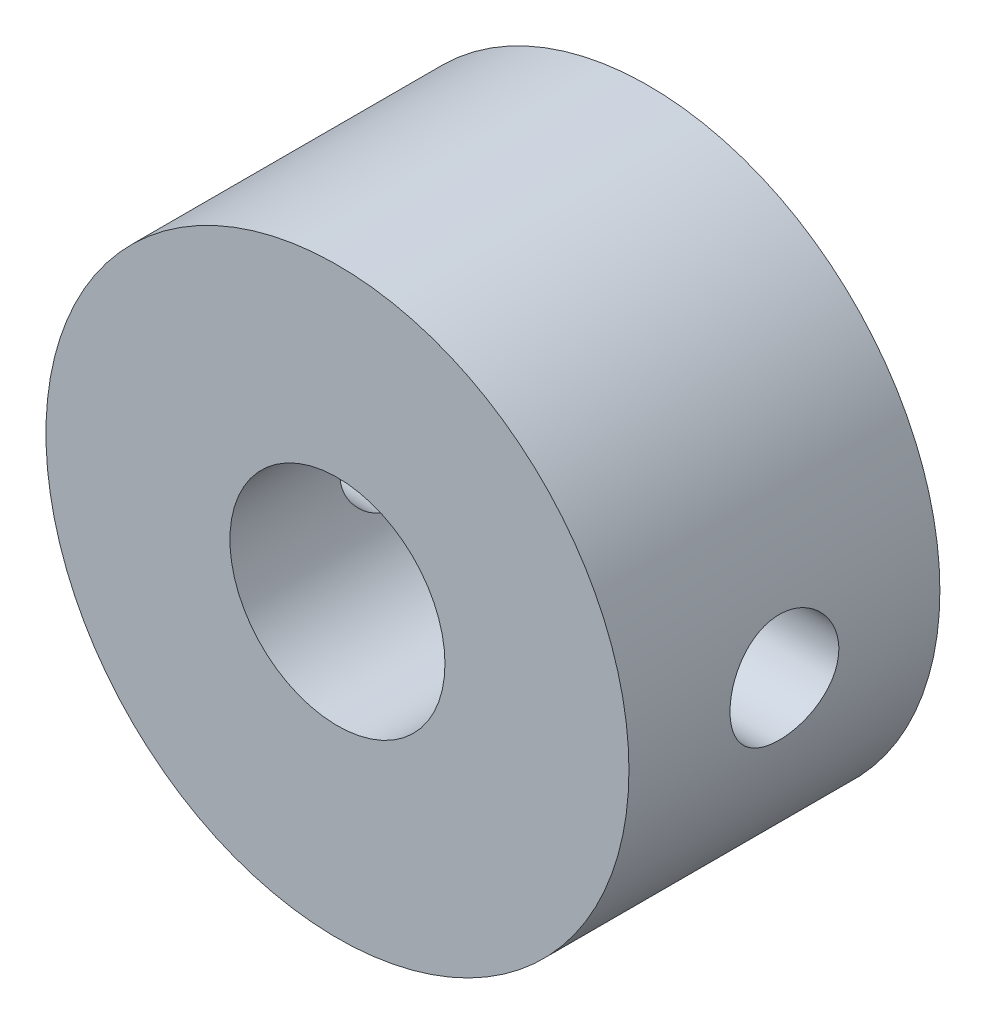
ISO-10303-21;
HEADER;
FILE_DESCRIPTION(('STEP AP214'),'2;1');
FILE_NAME('part.step','',(''),(''),'','','');
FILE_SCHEMA(('AUTOMOTIVE_DESIGN { 1 0 10303 214 1 1 1 1 }'));
ENDSEC;
DATA;
#1=APPLICATION_CONTEXT('core data for automotive mechanical design processes');
#2=APPLICATION_PROTOCOL_DEFINITION('international standard','automotive_design',2000,#1);
#3=PRODUCT_CONTEXT('',#1,'mechanical');
#4=PRODUCT('Part','Part','',(#3));
#5=PRODUCT_RELATED_PRODUCT_CATEGORY('part','',(#4));
#6=PRODUCT_DEFINITION_FORMATION('','',#4);
#7=PRODUCT_DEFINITION_CONTEXT('part definition',#1,'design');
#8=PRODUCT_DEFINITION('design','',#6,#7);
#9=PRODUCT_DEFINITION_SHAPE('','',#8);
#10=(LENGTH_UNIT() NAMED_UNIT(*) SI_UNIT(.MILLI.,.METRE.));
#11=(NAMED_UNIT(*) PLANE_ANGLE_UNIT() SI_UNIT($,.RADIAN.));
#12=(NAMED_UNIT(*) SI_UNIT($,.STERADIAN.) SOLID_ANGLE_UNIT());
#13=UNCERTAINTY_MEASURE_WITH_UNIT(LENGTH_MEASURE(1.E-05),#10,'distance_accuracy_value','');
#14=(GEOMETRIC_REPRESENTATION_CONTEXT(3) GLOBAL_UNCERTAINTY_ASSIGNED_CONTEXT((#13)) GLOBAL_UNIT_ASSIGNED_CONTEXT((#10,
#11,#12)) REPRESENTATION_CONTEXT('',''));
#15=CARTESIAN_POINT('',(0.,0.,0.));
#16=DIRECTION('',(0.,0.,1.));
#17=DIRECTION('',(1.,0.,0.));
#18=AXIS2_PLACEMENT_3D('',#15,#16,#17);
#19=CARTESIAN_POINT('',(0.,0.,12.));
#20=DIRECTION('',(0.,0.,-1.));
#21=DIRECTION('',(-1.,0.,0.));
#22=AXIS2_PLACEMENT_3D('',#19,#20,#21);
#23=CYLINDRICAL_SURFACE('',#22,11.25);
#24=CARTESIAN_POINT('',(11.25,0.,3.9));
#25=CARTESIAN_POINT('',(11.2499978868814,-0.116870051116427,3.90000447590363));
#26=CARTESIAN_POINT('',(11.2481600420372,-0.233798447592149,3.9097891163806));
#27=CARTESIAN_POINT('',(11.2410056507176,-0.464360917815712,3.94864432840249));
#28=CARTESIAN_POINT('',(11.2356861572907,-0.577992115568345,3.97773123814415));
#29=CARTESIAN_POINT('',(11.2221635884025,-0.798592353924978,4.05426986888635));
#30=CARTESIAN_POINT('',(11.2139631074613,-0.905567287240754,4.10170506990465));
#31=CARTESIAN_POINT('',(11.1955743057042,-1.11003012441761,4.21354703185403));
#32=CARTESIAN_POINT('',(11.185386148586,-1.20751880854071,4.27795239533853));
#33=CARTESIAN_POINT('',(11.1640114574066,-1.39140940904741,4.42271833437267));
#34=CARTESIAN_POINT('',(11.1528154579487,-1.47768239185122,4.50324130861667));
#35=CARTESIAN_POINT('',(11.130757285113,-1.63557728497731,4.67760736787961));
#36=CARTESIAN_POINT('',(11.1198951356345,-1.70719814846429,4.77145140382431));
#37=CARTESIAN_POINT('',(11.0996425217549,-1.83429119655592,4.970705812637));
#38=CARTESIAN_POINT('',(11.0902642625609,-1.88963237805692,5.07620109462547));
#39=CARTESIAN_POINT('',(11.07417455029,-1.98175653674892,5.29519586262491));
#40=CARTESIAN_POINT('',(11.0674628693758,-2.01854109952354,5.40869466382455));
#41=CARTESIAN_POINT('',(11.0575614563584,-2.07209436594482,5.63909561411088));
#42=CARTESIAN_POINT('',(11.0543322073595,-2.08908782994632,5.75594378919659));
#43=CARTESIAN_POINT('',(11.051642126767,-2.1032741275287,5.99087402748983));
#44=CARTESIAN_POINT('',(11.0521809602688,-2.10046872081991,6.10895598010858));
#45=CARTESIAN_POINT('',(11.0569301810734,-2.07531919863034,6.34137450229544));
#46=CARTESIAN_POINT('',(11.0610925645397,-2.05323053199279,6.45573983915365));
#47=CARTESIAN_POINT('',(11.0725444989122,-1.99054374047324,6.67911241268042));
#48=CARTESIAN_POINT('',(11.0798341816327,-1.94994483538877,6.78811942328214));
#49=CARTESIAN_POINT('',(11.0967696027246,-1.85113981590752,6.99842919401654));
#50=CARTESIAN_POINT('',(11.1064290941843,-1.79283043153035,7.09968228396997));
#51=CARTESIAN_POINT('',(11.1270066379781,-1.6603326907229,7.2910633009231));
#52=CARTESIAN_POINT('',(11.1379248168951,-1.58614273657983,7.38119010708974));
#53=CARTESIAN_POINT('',(11.1599987710771,-1.42261195754757,7.54923621697663));
#54=CARTESIAN_POINT('',(11.1711555939996,-1.33305261049536,7.62694288889261));
#55=CARTESIAN_POINT('',(11.1922930027306,-1.14205685485682,7.7662610741087));
#56=CARTESIAN_POINT('',(11.2022735769429,-1.04062032919803,7.82787242873913));
#57=CARTESIAN_POINT('',(11.219953826192,-0.828528745855031,7.93328188230094));
#58=CARTESIAN_POINT('',(11.2276506843014,-0.717862517149799,7.97705800637822));
#59=CARTESIAN_POINT('',(11.239874472381,-0.490571733845224,8.04534011685005));
#60=CARTESIAN_POINT('',(11.2444017360527,-0.37394780787197,8.06984813186379));
#61=CARTESIAN_POINT('',(11.2497304386783,-0.139881644484169,8.09860269412022));
#62=CARTESIAN_POINT('',(11.2505854509577,-0.0224763802554546,8.10314060328525));
#63=CARTESIAN_POINT('',(11.2486212472193,0.211415399049241,8.09260748821077));
#64=CARTESIAN_POINT('',(11.2458022100565,0.327901958570639,8.07753741850022));
#65=CARTESIAN_POINT('',(11.2368400115172,0.555726562485133,8.0284583703502));
#66=CARTESIAN_POINT('',(11.2307227134365,0.667097443864289,7.9945966865697));
#67=CARTESIAN_POINT('',(11.2158470873987,0.882581290626657,7.90905491420057));
#68=CARTESIAN_POINT('',(11.2070885813743,0.986693766073727,7.85737362420109));
#69=CARTESIAN_POINT('',(11.1877684460801,1.18594981965344,7.73701386621129));
#70=CARTESIAN_POINT('',(11.1771882977871,1.28098392485225,7.66815719861719));
#71=CARTESIAN_POINT('',(11.1554465897674,1.45825301019646,7.51564257745349));
#72=CARTESIAN_POINT('',(11.1442849763328,1.54048680521568,7.43198325489953));
#73=CARTESIAN_POINT('',(11.1224607802418,1.69092693866486,7.25091956269001));
#74=CARTESIAN_POINT('',(11.1118066935529,1.75893452205378,7.15334885954151));
#75=CARTESIAN_POINT('',(11.0923743313584,1.87759473329097,6.94799713175923));
#76=CARTESIAN_POINT('',(11.0835959865283,1.92824800256965,6.84021648468178));
#77=CARTESIAN_POINT('',(11.0689755852346,2.01047928957847,6.61801109158759));
#78=CARTESIAN_POINT('',(11.0631194788214,2.04214873142304,6.50362114636546));
#79=CARTESIAN_POINT('',(11.0549743761156,2.0857955829765,6.27102440999086));
#80=CARTESIAN_POINT('',(11.0526849813508,2.09777519243751,6.15281804671415));
#81=CARTESIAN_POINT('',(11.0519525995647,2.10162922782366,5.91793453193552));
#82=CARTESIAN_POINT('',(11.0534496373636,2.09381714096807,5.80126259593306));
#83=CARTESIAN_POINT('',(11.0599885186412,2.05899551456732,5.57092608843586));
#84=CARTESIAN_POINT('',(11.0650303413878,2.03198608729999,5.45726149935634));
#85=CARTESIAN_POINT('',(11.0780655519559,1.95966824453777,5.23633284660059));
#86=CARTESIAN_POINT('',(11.0860535090324,1.91439348405176,5.12905742543665));
#87=CARTESIAN_POINT('',(11.10408484369,1.80686435462856,4.92357509552195));
#88=CARTESIAN_POINT('',(11.1141283646886,1.74460880083505,4.8253688202226));
#89=CARTESIAN_POINT('',(11.1353255156762,1.60379420779912,4.63924161538022));
#90=CARTESIAN_POINT('',(11.1464934089391,1.52500691557208,4.5514949657355));
#91=CARTESIAN_POINT('',(11.1685739603769,1.3538415166877,4.390363163059));
#92=CARTESIAN_POINT('',(11.1794865593243,1.26146029181066,4.31698131409473));
#93=CARTESIAN_POINT('',(11.199940980724,1.06474339278036,4.18605177717303));
#94=CARTESIAN_POINT('',(11.2094697210551,0.960308524149111,4.12865102102413));
#95=CARTESIAN_POINT('',(11.2259550719315,0.743133418146286,4.03230149444511));
#96=CARTESIAN_POINT('',(11.2329141032262,0.630401117937854,3.99333534823079));
#97=CARTESIAN_POINT('',(11.2420529504133,0.431110689027436,3.94289599523633));
#98=CARTESIAN_POINT('',(11.2450163018428,0.345719445112447,3.92683741548476));
#99=CARTESIAN_POINT('',(11.2489905868845,0.17356283852604,3.90538788931853));
#100=CARTESIAN_POINT('',(11.2500015693793,0.0867975103132741,3.89999667581825));
#101=CARTESIAN_POINT('',(11.25,0.,3.9));
#102=B_SPLINE_CURVE_WITH_KNOTS('',3,(#24,#25,#26,#27,#28,#29,#30,#31,#32,#33,#34,#35,#36,#37,
#38,#39,#40,#41,#42,#43,#44,#45,#46,#47,#48,#49,#50,#51,#52,#53,#54,#55,#56,#57,#58,#59,#60,#61,
#62,#63,#64,#65,#66,#67,#68,#69,#70,#71,#72,#73,#74,#75,#76,#77,#78,#79,#80,#81,#82,#83,#84,#85,
#86,#87,#88,#89,#90,#91,#92,#93,#94,#95,#96,#97,#98,#99,#100,#101),.UNSPECIFIED.,.T.,.F.,(4,2,2,
2,2,2,2,2,2,2,2,2,2,2,2,2,2,2,2,2,2,2,2,2,2,2,2,2,2,2,2,2,2,2,2,2,2,2,4),(0.,0.350292735739653,
0.700882351808695,1.0511570446316,1.40140290229879,1.75537361189577,2.10936960245812,
2.46614082406495,2.82288155593299,3.1755301392632,3.52814737981906,3.87616312853408,
4.22419354739283,4.57429361698693,4.92442892602752,5.2800324415224,5.63563946246969,
5.99168331269157,6.34768967225222,6.69848433866071,7.0492619287995,7.39732807377546,
7.74541769021477,8.09728110313744,8.44917707424144,8.80570208384587,9.16221391455664,
9.51699473227074,9.8717359111044,10.2208934718768,10.570048990578,10.9185640856239,
11.2671035049747,11.6208157201289,11.9746091977649,12.331555466257,12.6881646167108,
12.9483279206454,13.2084847106235),.UNSPECIFIED.);
#103=CARTESIAN_POINT('',(11.25,0.,3.9));
#104=VERTEX_POINT('',#103);
#105=EDGE_CURVE('E10',#104,#104,#102,.T.);
#106=ORIENTED_EDGE('',*,*,#105,.T.);
#107=EDGE_LOOP('',(#106));
#108=FACE_BOUND('',#107,.T.);
#109=CARTESIAN_POINT('',(0.,0.,12.));
#110=DIRECTION('',(0.,0.,1.));
#111=DIRECTION('',(1.,0.,0.));
#112=AXIS2_PLACEMENT_3D('',#109,#110,#111);
#113=CIRCLE('',#112,11.25);
#114=CARTESIAN_POINT('',(11.25,0.,12.));
#115=VERTEX_POINT('',#114);
#116=EDGE_CURVE('E46',#115,#115,#113,.T.);
#117=ORIENTED_EDGE('',*,*,#116,.F.);
#118=EDGE_LOOP('',(#117));
#119=FACE_BOUND('',#118,.T.);
#120=CARTESIAN_POINT('',(0.,0.,0.));
#121=DIRECTION('',(0.,0.,1.));
#122=DIRECTION('',(1.,0.,0.));
#123=AXIS2_PLACEMENT_3D('',#120,#121,#122);
#124=CIRCLE('',#123,11.25);
#125=CARTESIAN_POINT('',(11.25,0.,0.));
#126=VERTEX_POINT('',#125);
#127=EDGE_CURVE('E51',#126,#126,#124,.T.);
#128=ORIENTED_EDGE('',*,*,#127,.T.);
#129=EDGE_LOOP('',(#128));
#130=FACE_BOUND('',#129,.T.);
#131=CARTESIAN_POINT('',(-11.25,0.,8.1));
#132=CARTESIAN_POINT('',(-11.2499978868814,0.116870051116427,8.09999552409637));
#133=CARTESIAN_POINT('',(-11.2481600420372,0.233798447592149,8.0902108836194));
#134=CARTESIAN_POINT('',(-11.2410056507176,0.464360917815712,8.05135567159751));
#135=CARTESIAN_POINT('',(-11.2356861572907,0.577992115568345,8.02226876185586));
#136=CARTESIAN_POINT('',(-11.2221635884025,0.798592353924978,7.94573013111365));
#137=CARTESIAN_POINT('',(-11.2139631074613,0.905567287240754,7.89829493009535));
#138=CARTESIAN_POINT('',(-11.1955743057042,1.11003012441761,7.78645296814597));
#139=CARTESIAN_POINT('',(-11.185386148586,1.20751880854071,7.72204760466147));
#140=CARTESIAN_POINT('',(-11.1640114574066,1.39140940904741,7.57728166562733));
#141=CARTESIAN_POINT('',(-11.1528154579487,1.47768239185122,7.49675869138333));
#142=CARTESIAN_POINT('',(-11.130757285113,1.63557728497731,7.32239263212039));
#143=CARTESIAN_POINT('',(-11.1198951356345,1.70719814846429,7.22854859617569));
#144=CARTESIAN_POINT('',(-11.0996425217549,1.83429119655592,7.029294187363));
#145=CARTESIAN_POINT('',(-11.0902642625609,1.88963237805692,6.92379890537453));
#146=CARTESIAN_POINT('',(-11.07417455029,1.98175653674892,6.70480413737509));
#147=CARTESIAN_POINT('',(-11.0674628693758,2.01854109952354,6.59130533617545));
#148=CARTESIAN_POINT('',(-11.0575614563584,2.07209436594482,6.36090438588912));
#149=CARTESIAN_POINT('',(-11.0543322073595,2.08908782994632,6.24405621080341));
#150=CARTESIAN_POINT('',(-11.051642126767,2.1032741275287,6.00912597251016));
#151=CARTESIAN_POINT('',(-11.0521809602688,2.10046872081991,5.89104401989142));
#152=CARTESIAN_POINT('',(-11.0569301810734,2.07531919863034,5.65862549770456));
#153=CARTESIAN_POINT('',(-11.0610925645397,2.05323053199278,5.54426016084635));
#154=CARTESIAN_POINT('',(-11.0725444989122,1.99054374047324,5.32088758731958));
#155=CARTESIAN_POINT('',(-11.0798341816327,1.94994483538877,5.21188057671786));
#156=CARTESIAN_POINT('',(-11.0967696027246,1.85113981590752,5.00157080598346));
#157=CARTESIAN_POINT('',(-11.1064290941843,1.79283043153035,4.90031771603003));
#158=CARTESIAN_POINT('',(-11.1270066379781,1.6603326907229,4.7089366990769));
#159=CARTESIAN_POINT('',(-11.1379248168951,1.58614273657983,4.61880989291026));
#160=CARTESIAN_POINT('',(-11.1599987710771,1.42261195754757,4.45076378302337));
#161=CARTESIAN_POINT('',(-11.1711555939996,1.33305261049536,4.37305711110739));
#162=CARTESIAN_POINT('',(-11.1922930027306,1.14205685485682,4.2337389258913));
#163=CARTESIAN_POINT('',(-11.2022735769429,1.04062032919803,4.17212757126087));
#164=CARTESIAN_POINT('',(-11.219953826192,0.828528745855031,4.06671811769906));
#165=CARTESIAN_POINT('',(-11.2276506843014,0.717862517149799,4.02294199362178));
#166=CARTESIAN_POINT('',(-11.239874472381,0.490571733845224,3.95465988314996));
#167=CARTESIAN_POINT('',(-11.2444017360527,0.373947807871971,3.93015186813621));
#168=CARTESIAN_POINT('',(-11.2497304386783,0.13988164448417,3.90139730587978));
#169=CARTESIAN_POINT('',(-11.2505854509577,0.0224763802554553,3.89685939671475));
#170=CARTESIAN_POINT('',(-11.2486212472193,-0.211415399049241,3.90739251178923));
#171=CARTESIAN_POINT('',(-11.2458022100565,-0.327901958570638,3.92246258149978));
#172=CARTESIAN_POINT('',(-11.2368400115172,-0.555726562485133,3.9715416296498));
#173=CARTESIAN_POINT('',(-11.2307227134365,-0.667097443864289,4.0054033134303));
#174=CARTESIAN_POINT('',(-11.2158470873987,-0.882581290626657,4.09094508579943));
#175=CARTESIAN_POINT('',(-11.2070885813743,-0.986693766073727,4.14262637579891));
#176=CARTESIAN_POINT('',(-11.1877684460801,-1.18594981965343,4.26298613378871));
#177=CARTESIAN_POINT('',(-11.1771882977871,-1.28098392485225,4.33184280138281));
#178=CARTESIAN_POINT('',(-11.1554465897674,-1.45825301019646,4.4843574225465));
#179=CARTESIAN_POINT('',(-11.1442849763328,-1.54048680521568,4.56801674510047));
#180=CARTESIAN_POINT('',(-11.1224607802418,-1.69092693866486,4.74908043730998));
#181=CARTESIAN_POINT('',(-11.1118066935529,-1.75893452205378,4.84665114045849));
#182=CARTESIAN_POINT('',(-11.0923743313584,-1.87759473329096,5.05200286824077));
#183=CARTESIAN_POINT('',(-11.0835959865283,-1.92824800256965,5.15978351531822));
#184=CARTESIAN_POINT('',(-11.0689755852346,-2.01047928957847,5.38198890841241));
#185=CARTESIAN_POINT('',(-11.0631194788214,-2.04214873142304,5.49637885363454));
#186=CARTESIAN_POINT('',(-11.0549743761156,-2.0857955829765,5.72897559000913));
#187=CARTESIAN_POINT('',(-11.0526849813508,-2.09777519243751,5.84718195328585));
#188=CARTESIAN_POINT('',(-11.0519525995647,-2.10162922782366,6.08206546806448));
#189=CARTESIAN_POINT('',(-11.0534496373636,-2.09381714096807,6.19873740406693));
#190=CARTESIAN_POINT('',(-11.0599885186412,-2.05899551456732,6.42907391156413));
#191=CARTESIAN_POINT('',(-11.0650303413878,-2.03198608729999,6.54273850064366));
#192=CARTESIAN_POINT('',(-11.0780655519559,-1.95966824453777,6.76366715339941));
#193=CARTESIAN_POINT('',(-11.0860535090324,-1.91439348405176,6.87094257456335));
#194=CARTESIAN_POINT('',(-11.10408484369,-1.80686435462856,7.07642490447805));
#195=CARTESIAN_POINT('',(-11.1141283646886,-1.74460880083505,7.1746311797774));
#196=CARTESIAN_POINT('',(-11.1353255156762,-1.60379420779912,7.36075838461978));
#197=CARTESIAN_POINT('',(-11.1464934089391,-1.52500691557208,7.4485050342645));
#198=CARTESIAN_POINT('',(-11.1685739603769,-1.3538415166877,7.60963683694099));
#199=CARTESIAN_POINT('',(-11.1794865593243,-1.26146029181066,7.68301868590527));
#200=CARTESIAN_POINT('',(-11.199940980724,-1.06474339278036,7.81394822282697));
#201=CARTESIAN_POINT('',(-11.2094697210551,-0.960308524149112,7.87134897897587));
#202=CARTESIAN_POINT('',(-11.2259550719315,-0.743133418146287,7.96769850555489));
#203=CARTESIAN_POINT('',(-11.2329141032262,-0.630401117937855,8.00666465176921));
#204=CARTESIAN_POINT('',(-11.2420529504133,-0.431110689027437,8.05710400476367));
#205=CARTESIAN_POINT('',(-11.2450163018428,-0.345719445112447,8.07316258451524));
#206=CARTESIAN_POINT('',(-11.2489905868845,-0.17356283852604,8.09461211068147));
#207=CARTESIAN_POINT('',(-11.2500015693793,-0.0867975103132742,8.10000332418175));
#208=CARTESIAN_POINT('',(-11.25,0.,8.1));
#209=B_SPLINE_CURVE_WITH_KNOTS('',3,(#131,#132,#133,#134,#135,#136,#137,#138,#139,#140,#141,
#142,#143,#144,#145,#146,#147,#148,#149,#150,#151,#152,#153,#154,#155,#156,#157,#158,#159,#160,
#161,#162,#163,#164,#165,#166,#167,#168,#169,#170,#171,#172,#173,#174,#175,#176,#177,#178,#179,
#180,#181,#182,#183,#184,#185,#186,#187,#188,#189,#190,#191,#192,#193,#194,#195,#196,#197,#198,
#199,#200,#201,#202,#203,#204,#205,#206,#207,#208),.UNSPECIFIED.,.T.,.F.,(4,2,2,2,2,2,2,2,2,2,2,
2,2,2,2,2,2,2,2,2,2,2,2,2,2,2,2,2,2,2,2,2,2,2,2,2,2,2,4),(0.,0.350292735739653,
0.700882351808695,1.0511570446316,1.40140290229879,1.75537361189577,2.10936960245812,
2.46614082406495,2.82288155593299,3.1755301392632,3.52814737981906,3.87616312853408,
4.22419354739283,4.57429361698693,4.92442892602752,5.2800324415224,5.63563946246969,
5.99168331269157,6.34768967225222,6.69848433866071,7.0492619287995,7.39732807377545,
7.74541769021477,8.09728110313744,8.44917707424144,8.80570208384586,9.16221391455664,
9.51699473227074,9.87173591110439,10.2208934718767,10.570048990578,10.9185640856239,
11.2671035049747,11.6208157201289,11.9746091977649,12.331555466257,12.6881646167108,
12.9483279206454,13.2084847106235),.UNSPECIFIED.);
#210=CARTESIAN_POINT('',(-11.25,0.,8.1));
#211=VERTEX_POINT('',#210);
#212=EDGE_CURVE('E42',#211,#211,#209,.T.);
#213=ORIENTED_EDGE('',*,*,#212,.F.);
#214=EDGE_LOOP('',(#213));
#215=FACE_BOUND('',#214,.T.);
#216=ADVANCED_FACE('F31',(#108,#119,#130,#215),#23,.T.);
#217=CARTESIAN_POINT('',(0.,0.,12.));
#218=DIRECTION('',(0.,0.,1.));
#219=DIRECTION('',(1.,0.,0.));
#220=AXIS2_PLACEMENT_3D('',#217,#218,#219);
#221=PLANE('',#220);
#222=CARTESIAN_POINT('',(0.,0.,12.));
#223=DIRECTION('',(0.,0.,1.));
#224=DIRECTION('',(1.,0.,0.));
#225=AXIS2_PLACEMENT_3D('',#222,#223,#224);
#226=CIRCLE('',#225,4.15);
#227=CARTESIAN_POINT('',(4.15,0.,12.));
#228=VERTEX_POINT('',#227);
#229=EDGE_CURVE('E120',#228,#228,#226,.T.);
#230=ORIENTED_EDGE('',*,*,#229,.F.);
#231=EDGE_LOOP('',(#230));
#232=FACE_BOUND('',#231,.T.);
#233=ORIENTED_EDGE('',*,*,#116,.T.);
#234=EDGE_LOOP('',(#233));
#235=FACE_BOUND('',#234,.T.);
#236=ADVANCED_FACE('F80',(#232,#235),#221,.T.);
#237=CARTESIAN_POINT('',(0.,0.,0.));
#238=DIRECTION('',(0.,0.,1.));
#239=DIRECTION('',(1.,0.,0.));
#240=AXIS2_PLACEMENT_3D('',#237,#238,#239);
#241=PLANE('',#240);
#242=CARTESIAN_POINT('',(0.,0.,0.));
#243=DIRECTION('',(0.,0.,1.));
#244=DIRECTION('',(1.,0.,0.));
#245=AXIS2_PLACEMENT_3D('',#242,#243,#244);
#246=CIRCLE('',#245,4.15);
#247=CARTESIAN_POINT('',(4.15,0.,0.));
#248=VERTEX_POINT('',#247);
#249=EDGE_CURVE('E59',#248,#248,#246,.T.);
#250=ORIENTED_EDGE('',*,*,#249,.T.);
#251=EDGE_LOOP('',(#250));
#252=FACE_BOUND('',#251,.T.);
#253=ORIENTED_EDGE('',*,*,#127,.F.);
#254=EDGE_LOOP('',(#253));
#255=FACE_BOUND('',#254,.T.);
#256=ADVANCED_FACE('F78',(#252,#255),#241,.F.);
#257=CARTESIAN_POINT('',(0.,0.,-3.));
#258=DIRECTION('',(0.,0.,1.));
#259=DIRECTION('',(1.,0.,0.));
#260=AXIS2_PLACEMENT_3D('',#257,#258,#259);
#261=CYLINDRICAL_SURFACE('',#260,4.15);
#262=CARTESIAN_POINT('',(4.15,0.,4.25));
#263=CARTESIAN_POINT('',(4.1499921377917,0.0936446575118376,4.2500104104991));
#264=CARTESIAN_POINT('',(4.14679380048449,0.187431558760664,4.25756098622883));
#265=CARTESIAN_POINT('',(4.1343083537334,0.372342820791373,4.28749287348827));
#266=CARTESIAN_POINT('',(4.12500556957409,0.463459694685645,4.30991236632287));
#267=CARTESIAN_POINT('',(4.10130975719161,0.640051180724147,4.36860244213138));
#268=CARTESIAN_POINT('',(4.08693415483236,0.725543934448861,4.40482564099729));
#269=CARTESIAN_POINT('',(4.05448758679234,0.889154804972526,4.48989691944398));
#270=CARTESIAN_POINT('',(4.03641769105271,0.967275047444744,4.53874134474399));
#271=CARTESIAN_POINT('',(3.99735143213994,1.11804663223749,4.65030653640359));
#272=CARTESIAN_POINT('',(3.9762577322235,1.19027138833862,4.71356939921249));
#273=CARTESIAN_POINT('',(3.93393709134473,1.32345450432782,4.85102875647877));
#274=CARTESIAN_POINT('',(3.91271008496327,1.38440679831277,4.92523109928418));
#275=CARTESIAN_POINT('',(3.87132069015569,1.49636986680942,5.08701918327817));
#276=CARTESIAN_POINT('',(3.85126677417187,1.54672026729418,5.17509260340311));
#277=CARTESIAN_POINT('',(3.81604282034983,1.63170128549546,5.35942575339755));
#278=CARTESIAN_POINT('',(3.80087020770158,1.66634019473956,5.45568113342532));
#279=CARTESIAN_POINT('',(3.77818288562796,1.71714251569924,5.64873514287619));
#280=CARTESIAN_POINT('',(3.77032937759071,1.73412803628182,5.74527605878928));
#281=CARTESIAN_POINT('',(3.76219793676722,1.75170504160298,5.94013251261016));
#282=CARTESIAN_POINT('',(3.7619156793392,1.75230588514992,6.03844700534666));
#283=CARTESIAN_POINT('',(3.76867261237999,1.73771458064525,6.22577784014138));
#284=CARTESIAN_POINT('',(3.77513604622245,1.72376443889846,6.31491590473204));
#285=CARTESIAN_POINT('',(3.79368108814109,1.6825542788096,6.48944271845688));
#286=CARTESIAN_POINT('',(3.80576380312041,1.65529163807803,6.57483072526475));
#287=CARTESIAN_POINT('',(3.83446069062696,1.58769616832015,6.7416167476815));
#288=CARTESIAN_POINT('',(3.85116677889495,1.54709471104665,6.82288936529609));
#289=CARTESIAN_POINT('',(3.88720790925277,1.45416455505379,6.97778906884166));
#290=CARTESIAN_POINT('',(3.90654400078202,1.40183116956051,7.05141308199141));
#291=CARTESIAN_POINT('',(3.94770666745766,1.28159444640128,7.19564887840822));
#292=CARTESIAN_POINT('',(3.96960376842245,1.2127341884654,7.26544513029954));
#293=CARTESIAN_POINT('',(4.01200899566064,1.06407447342045,7.39277651544894));
#294=CARTESIAN_POINT('',(4.03251677989905,0.984272337054492,7.45030863683817));
#295=CARTESIAN_POINT('',(4.07045462848876,0.813464617096305,7.55271436676433));
#296=CARTESIAN_POINT('',(4.08779836035945,0.722234931480784,7.59724854764615));
#297=CARTESIAN_POINT('',(4.1167880587395,0.53266017169472,7.6700497699493));
#298=CARTESIAN_POINT('',(4.12843725203035,0.434319163471058,7.69832602544613));
#299=CARTESIAN_POINT('',(4.14411801089039,0.240122003362773,7.73608399285323));
#300=CARTESIAN_POINT('',(4.14859219515282,0.144514276661452,7.74665968553247));
#301=CARTESIAN_POINT('',(4.15083738159274,-0.0472069982318758,7.75198738119891));
#302=CARTESIAN_POINT('',(4.14861036798049,-0.143320388285313,7.74674406815839));
#303=CARTESIAN_POINT('',(4.13798948295354,-0.328150621900008,7.72135889446721));
#304=CARTESIAN_POINT('',(4.1299165391256,-0.416994462071207,7.70199200708503));
#305=CARTESIAN_POINT('',(4.1087617591124,-0.590070530991004,7.64999547807517));
#306=CARTESIAN_POINT('',(4.09567929398035,-0.674302179159231,7.61736417106427));
#307=CARTESIAN_POINT('',(4.06524882657585,-0.838727602897792,7.53870123810016));
#308=CARTESIAN_POINT('',(4.04778064188386,-0.9187138530197,7.49228383814392));
#309=CARTESIAN_POINT('',(4.01043388006721,-1.07004926173974,7.38778929976251));
#310=CARTESIAN_POINT('',(3.99055428778418,-1.14139475730383,7.32970724393787));
#311=CARTESIAN_POINT('',(3.94872489679292,-1.27890934715151,7.1985674012218));
#312=CARTESIAN_POINT('',(3.92673000734612,-1.34431856958317,7.12472515887349));
#313=CARTESIAN_POINT('',(3.88443955911337,-1.46203672053772,6.96677429998981));
#314=CARTESIAN_POINT('',(3.86414442246185,-1.51434240117416,6.8826631458373));
#315=CARTESIAN_POINT('',(3.82738542998614,-1.60501161084637,6.70467196810612));
#316=CARTESIAN_POINT('',(3.81098698902189,-1.64314244436484,6.61065888958929));
#317=CARTESIAN_POINT('',(3.78475747451931,-1.70270064967061,6.41663562630746));
#318=CARTESIAN_POINT('',(3.77492080913855,-1.72414224637083,6.31663062718285));
#319=CARTESIAN_POINT('',(3.76379660815338,-1.74828359620492,6.12191491974964));
#320=CARTESIAN_POINT('',(3.76189895581579,-1.75232163472918,6.02740431017418));
#321=CARTESIAN_POINT('',(3.76523994305899,-1.74513172404051,5.83910409981453));
#322=CARTESIAN_POINT('',(3.77047742149539,-1.73390625875344,5.74531438421244));
#323=CARTESIAN_POINT('',(3.78693514951877,-1.6976411504402,5.56584428756434));
#324=CARTESIAN_POINT('',(3.79785077630832,-1.67330281018292,5.47999155634643));
#325=CARTESIAN_POINT('',(3.82418869409413,-1.61219780773075,5.31357332621211));
#326=CARTESIAN_POINT('',(3.83961225756201,-1.57542763589769,5.23300932803952));
#327=CARTESIAN_POINT('',(3.87439282642337,-1.48792550274574,5.07409478538728));
#328=CARTESIAN_POINT('',(3.89393223132189,-1.43647938375445,4.99617816442513));
#329=CARTESIAN_POINT('',(3.93424701727439,-1.3220727092005,4.84966530581522));
#330=CARTESIAN_POINT('',(3.95502284157243,-1.25910800735935,4.78107243993386));
#331=CARTESIAN_POINT('',(3.99734975707074,-1.11782226312233,4.64983220527819));
#332=CARTESIAN_POINT('',(4.01884128867684,-1.03870156378223,4.58802240313793));
#333=CARTESIAN_POINT('',(4.05861206096965,-0.870420584449584,4.47850650994384));
#334=CARTESIAN_POINT('',(4.07688984095584,-0.781255769301184,4.43080682547309));
#335=CARTESIAN_POINT('',(4.10792585869459,-0.596711599873814,4.35186379842544));
#336=CARTESIAN_POINT('',(4.12076651554963,-0.5014522801665,4.32037303943047));
#337=CARTESIAN_POINT('',(4.13981520470269,-0.306501962143952,4.27415926033159));
#338=CARTESIAN_POINT('',(4.14604390938879,-0.206825797447581,4.25938396943309));
#339=CARTESIAN_POINT('',(4.149544902475,-0.0711780028423431,4.25108176055515));
#340=CARTESIAN_POINT('',(4.15000298884058,-0.0355992796804156,4.24999604241952));
#341=CARTESIAN_POINT('',(4.15,0.,4.25));
#342=B_SPLINE_CURVE_WITH_KNOTS('',3,(#262,#263,#264,#265,#266,#267,#268,#269,#270,#271,#272,
#273,#274,#275,#276,#277,#278,#279,#280,#281,#282,#283,#284,#285,#286,#287,#288,#289,#290,#291,
#292,#293,#294,#295,#296,#297,#298,#299,#300,#301,#302,#303,#304,#305,#306,#307,#308,#309,#310,
#311,#312,#313,#314,#315,#316,#317,#318,#319,#320,#321,#322,#323,#324,#325,#326,#327,#328,#329,
#330,#331,#332,#333,#334,#335,#336,#337,#338,#339,#340,#341),.UNSPECIFIED.,.T.,.F.,(4,2,2,2,2,2,
2,2,2,2,2,2,2,2,2,2,2,2,2,2,2,2,2,2,2,2,2,2,2,2,2,2,2,2,2,2,2,2,2,4),(0.,0.280830833112297,
0.562385607288769,0.84298246728162,1.12349817565186,1.41713191238664,1.71092320155793,
2.01960354429068,2.32812079505801,2.62152116064178,2.91475393455793,3.18485662665197,
3.45501254694742,3.73098184586254,4.00706158850818,4.30709401755878,4.60720004497129,
4.91455694819836,5.22173948672303,5.50912154734322,5.79641852312902,6.06903525457763,
6.34168622435989,6.62283067862881,6.90409390302034,7.20592169332531,7.50782422179252,
7.81448426256358,8.1208826374569,8.40324509634971,8.68556161012492,8.9540927823562,
9.22269982718023,9.50767235729762,9.79274766992031,10.0993056663207,10.4060026399688,
10.7078678741801,11.0087865161983,11.115545146498),.UNSPECIFIED.);
#343=CARTESIAN_POINT('',(4.15,0.,4.25));
#344=VERTEX_POINT('',#343);
#345=EDGE_CURVE('E82',#344,#344,#342,.T.);
#346=ORIENTED_EDGE('',*,*,#345,.T.);
#347=EDGE_LOOP('',(#346));
#348=FACE_BOUND('',#347,.T.);
#349=CARTESIAN_POINT('',(-4.15,0.,7.75));
#350=CARTESIAN_POINT('',(-4.1499921377917,0.0936446575118376,7.7499895895009));
#351=CARTESIAN_POINT('',(-4.14679380048449,0.187431558760664,7.74243901377117));
#352=CARTESIAN_POINT('',(-4.1343083537334,0.372342820791373,7.71250712651173));
#353=CARTESIAN_POINT('',(-4.12500556957409,0.463459694685645,7.69008763367713));
#354=CARTESIAN_POINT('',(-4.10130975719161,0.640051180724147,7.63139755786862));
#355=CARTESIAN_POINT('',(-4.08693415483236,0.725543934448862,7.59517435900271));
#356=CARTESIAN_POINT('',(-4.05448758679234,0.889154804972526,7.51010308055602));
#357=CARTESIAN_POINT('',(-4.03641769105271,0.967275047444744,7.46125865525601));
#358=CARTESIAN_POINT('',(-3.99735143213994,1.11804663223749,7.34969346359641));
#359=CARTESIAN_POINT('',(-3.9762577322235,1.19027138833862,7.28643060078751));
#360=CARTESIAN_POINT('',(-3.93393709134473,1.32345450432782,7.14897124352123));
#361=CARTESIAN_POINT('',(-3.91271008496327,1.38440679831277,7.07476890071582));
#362=CARTESIAN_POINT('',(-3.87132069015569,1.49636986680942,6.91298081672183));
#363=CARTESIAN_POINT('',(-3.85126677417187,1.54672026729418,6.82490739659689));
#364=CARTESIAN_POINT('',(-3.81604282034983,1.63170128549546,6.64057424660245));
#365=CARTESIAN_POINT('',(-3.80087020770158,1.66634019473956,6.54431886657468));
#366=CARTESIAN_POINT('',(-3.77818288562796,1.71714251569924,6.35126485712381));
#367=CARTESIAN_POINT('',(-3.77032937759071,1.73412803628182,6.25472394121072));
#368=CARTESIAN_POINT('',(-3.76219793676722,1.75170504160298,6.05986748738984));
#369=CARTESIAN_POINT('',(-3.7619156793392,1.75230588514992,5.96155299465334));
#370=CARTESIAN_POINT('',(-3.76867261237999,1.73771458064525,5.77422215985862));
#371=CARTESIAN_POINT('',(-3.77513604622245,1.72376443889846,5.68508409526796));
#372=CARTESIAN_POINT('',(-3.79368108814109,1.6825542788096,5.51055728154312));
#373=CARTESIAN_POINT('',(-3.80576380312041,1.65529163807803,5.42516927473525));
#374=CARTESIAN_POINT('',(-3.83446069062696,1.58769616832015,5.2583832523185));
#375=CARTESIAN_POINT('',(-3.85116677889495,1.54709471104665,5.17711063470392));
#376=CARTESIAN_POINT('',(-3.88720790925277,1.45416455505379,5.02221093115834));
#377=CARTESIAN_POINT('',(-3.90654400078202,1.40183116956051,4.94858691800859));
#378=CARTESIAN_POINT('',(-3.94770666745766,1.28159444640128,4.80435112159178));
#379=CARTESIAN_POINT('',(-3.96960376842245,1.2127341884654,4.73455486970046));
#380=CARTESIAN_POINT('',(-4.01200899566064,1.06407447342045,4.60722348455106));
#381=CARTESIAN_POINT('',(-4.03251677989905,0.984272337054492,4.54969136316184));
#382=CARTESIAN_POINT('',(-4.07045462848876,0.813464617096305,4.44728563323567));
#383=CARTESIAN_POINT('',(-4.08779836035945,0.722234931480784,4.40275145235385));
#384=CARTESIAN_POINT('',(-4.1167880587395,0.53266017169472,4.3299502300507));
#385=CARTESIAN_POINT('',(-4.12843725203035,0.434319163471058,4.30167397455387));
#386=CARTESIAN_POINT('',(-4.14411801089039,0.240122003362773,4.26391600714677));
#387=CARTESIAN_POINT('',(-4.14859219515282,0.144514276661452,4.25334031446754));
#388=CARTESIAN_POINT('',(-4.15083738159274,-0.0472069982318758,4.24801261880109));
#389=CARTESIAN_POINT('',(-4.14861036798049,-0.143320388285313,4.25325593184161));
#390=CARTESIAN_POINT('',(-4.13798948295354,-0.328150621900008,4.27864110553279));
#391=CARTESIAN_POINT('',(-4.1299165391256,-0.416994462071207,4.29800799291497));
#392=CARTESIAN_POINT('',(-4.1087617591124,-0.590070530991004,4.35000452192483));
#393=CARTESIAN_POINT('',(-4.09567929398035,-0.674302179159231,4.38263582893573));
#394=CARTESIAN_POINT('',(-4.06524882657585,-0.838727602897792,4.46129876189984));
#395=CARTESIAN_POINT('',(-4.04778064188386,-0.9187138530197,4.50771616185608));
#396=CARTESIAN_POINT('',(-4.01043388006721,-1.07004926173974,4.61221070023749));
#397=CARTESIAN_POINT('',(-3.99055428778418,-1.14139475730383,4.67029275606213));
#398=CARTESIAN_POINT('',(-3.94872489679292,-1.27890934715151,4.8014325987782));
#399=CARTESIAN_POINT('',(-3.92673000734612,-1.34431856958317,4.87527484112651));
#400=CARTESIAN_POINT('',(-3.88443955911337,-1.46203672053772,5.03322570001019));
#401=CARTESIAN_POINT('',(-3.86414442246185,-1.51434240117416,5.1173368541627));
#402=CARTESIAN_POINT('',(-3.82738542998614,-1.60501161084637,5.29532803189388));
#403=CARTESIAN_POINT('',(-3.81098698902189,-1.64314244436484,5.38934111041071));
#404=CARTESIAN_POINT('',(-3.78475747451931,-1.70270064967061,5.58336437369254));
#405=CARTESIAN_POINT('',(-3.77492080913855,-1.72414224637083,5.68336937281715));
#406=CARTESIAN_POINT('',(-3.76379660815338,-1.74828359620492,5.87808508025036));
#407=CARTESIAN_POINT('',(-3.76189895581579,-1.75232163472918,5.97259568982582));
#408=CARTESIAN_POINT('',(-3.76523994305899,-1.74513172404051,6.16089590018547));
#409=CARTESIAN_POINT('',(-3.77047742149539,-1.73390625875344,6.25468561578756));
#410=CARTESIAN_POINT('',(-3.78693514951877,-1.6976411504402,6.43415571243566));
#411=CARTESIAN_POINT('',(-3.79785077630832,-1.67330281018292,6.52000844365357));
#412=CARTESIAN_POINT('',(-3.82418869409413,-1.61219780773075,6.68642667378789));
#413=CARTESIAN_POINT('',(-3.83961225756201,-1.57542763589769,6.76699067196048));
#414=CARTESIAN_POINT('',(-3.87439282642337,-1.48792550274574,6.92590521461272));
#415=CARTESIAN_POINT('',(-3.89393223132189,-1.43647938375445,7.00382183557487));
#416=CARTESIAN_POINT('',(-3.93424701727439,-1.32207270920051,7.15033469418478));
#417=CARTESIAN_POINT('',(-3.95502284157243,-1.25910800735935,7.21892756006614));
#418=CARTESIAN_POINT('',(-3.99734975707074,-1.11782226312233,7.35016779472181));
#419=CARTESIAN_POINT('',(-4.01884128867684,-1.03870156378223,7.41197759686207));
#420=CARTESIAN_POINT('',(-4.05861206096965,-0.870420584449583,7.52149349005616));
#421=CARTESIAN_POINT('',(-4.07688984095584,-0.781255769301184,7.56919317452691));
#422=CARTESIAN_POINT('',(-4.10792585869459,-0.596711599873814,7.64813620157456));
#423=CARTESIAN_POINT('',(-4.12076651554963,-0.5014522801665,7.67962696056953));
#424=CARTESIAN_POINT('',(-4.13981520470269,-0.306501962143952,7.72584073966841));
#425=CARTESIAN_POINT('',(-4.14604390938879,-0.206825797447581,7.74061603056692));
#426=CARTESIAN_POINT('',(-4.149544902475,-0.0711780028423433,7.74891823944485));
#427=CARTESIAN_POINT('',(-4.15000298884058,-0.0355992796804157,7.75000395758048));
#428=CARTESIAN_POINT('',(-4.15,0.,7.75));
#429=B_SPLINE_CURVE_WITH_KNOTS('',3,(#349,#350,#351,#352,#353,#354,#355,#356,#357,#358,#359,
#360,#361,#362,#363,#364,#365,#366,#367,#368,#369,#370,#371,#372,#373,#374,#375,#376,#377,#378,
#379,#380,#381,#382,#383,#384,#385,#386,#387,#388,#389,#390,#391,#392,#393,#394,#395,#396,#397,
#398,#399,#400,#401,#402,#403,#404,#405,#406,#407,#408,#409,#410,#411,#412,#413,#414,#415,#416,
#417,#418,#419,#420,#421,#422,#423,#424,#425,#426,#427,#428),.UNSPECIFIED.,.T.,.F.,(4,2,2,2,2,2,
2,2,2,2,2,2,2,2,2,2,2,2,2,2,2,2,2,2,2,2,2,2,2,2,2,2,2,2,2,2,2,2,2,4),(0.,0.280830833112297,
0.562385607288769,0.84298246728162,1.12349817565186,1.41713191238664,1.71092320155793,
2.01960354429068,2.32812079505801,2.62152116064178,2.91475393455793,3.18485662665197,
3.45501254694742,3.73098184586254,4.00706158850818,4.30709401755878,4.60720004497129,
4.91455694819836,5.22173948672303,5.50912154734322,5.79641852312902,6.06903525457763,
6.34168622435989,6.62283067862881,6.90409390302034,7.20592169332531,7.50782422179252,
7.81448426256357,8.1208826374569,8.40324509634971,8.68556161012492,8.9540927823562,
9.22269982718023,9.50767235729762,9.79274766992031,10.0993056663207,10.4060026399688,
10.7078678741801,11.0087865161983,11.115545146498),.UNSPECIFIED.);
#430=CARTESIAN_POINT('',(-4.15,0.,7.75));
#431=VERTEX_POINT('',#430);
#432=EDGE_CURVE('E61',#431,#431,#429,.T.);
#433=ORIENTED_EDGE('',*,*,#432,.T.);
#434=EDGE_LOOP('',(#433));
#435=FACE_BOUND('',#434,.T.);
#436=ORIENTED_EDGE('',*,*,#229,.T.);
#437=EDGE_LOOP('',(#436));
#438=FACE_BOUND('',#437,.T.);
#439=ORIENTED_EDGE('',*,*,#249,.F.);
#440=EDGE_LOOP('',(#439));
#441=FACE_BOUND('',#440,.T.);
#442=ADVANCED_FACE('F73',(#348,#435,#438,#441),#261,.F.);
#443=CARTESIAN_POINT('',(-6.25,0.,6.));
#444=DIRECTION('',(-1.,0.,0.));
#445=DIRECTION('',(0.,0.,1.));
#446=AXIS2_PLACEMENT_3D('',#443,#444,#445);
#447=CYLINDRICAL_SURFACE('',#446,2.1);
#448=CARTESIAN_POINT('',(-6.25,0.,6.));
#449=DIRECTION('',(1.,0.,0.));
#450=DIRECTION('',(0.,0.,-1.));
#451=AXIS2_PLACEMENT_3D('',#448,#449,#450);
#452=CIRCLE('',#451,2.1);
#453=CARTESIAN_POINT('',(-6.25,0.,3.9));
#454=VERTEX_POINT('',#453);
#455=EDGE_CURVE('E87',#454,#454,#452,.T.);
#456=ORIENTED_EDGE('',*,*,#455,.T.);
#457=EDGE_LOOP('',(#456));
#458=FACE_BOUND('',#457,.T.);
#459=ORIENTED_EDGE('',*,*,#212,.T.);
#460=EDGE_LOOP('',(#459));
#461=FACE_BOUND('',#460,.T.);
#462=ADVANCED_FACE('F68',(#458,#461),#447,.F.);
#463=CARTESIAN_POINT('',(-6.25,0.,6.));
#464=DIRECTION('',(1.,0.,0.));
#465=DIRECTION('',(0.,0.,-1.));
#466=AXIS2_PLACEMENT_3D('',#463,#464,#465);
#467=PLANE('',#466);
#468=CARTESIAN_POINT('',(-6.25,0.,6.));
#469=DIRECTION('',(-1.,0.,0.));
#470=DIRECTION('',(0.,0.,1.));
#471=AXIS2_PLACEMENT_3D('',#468,#469,#470);
#472=CIRCLE('',#471,1.75);
#473=CARTESIAN_POINT('',(-6.25,0.,7.75));
#474=VERTEX_POINT('',#473);
#475=EDGE_CURVE('E126',#474,#474,#472,.T.);
#476=ORIENTED_EDGE('',*,*,#475,.F.);
#477=EDGE_LOOP('',(#476));
#478=FACE_BOUND('',#477,.T.);
#479=ORIENTED_EDGE('',*,*,#455,.F.);
#480=EDGE_LOOP('',(#479));
#481=FACE_BOUND('',#480,.T.);
#482=ADVANCED_FACE('F72',(#478,#481),#467,.F.);
#483=CARTESIAN_POINT('',(11.25,0.,6.));
#484=DIRECTION('',(-1.,0.,0.));
#485=DIRECTION('',(0.,0.,1.));
#486=AXIS2_PLACEMENT_3D('',#483,#484,#485);
#487=CYLINDRICAL_SURFACE('',#486,1.75);
#488=ORIENTED_EDGE('',*,*,#475,.T.);
#489=EDGE_LOOP('',(#488));
#490=FACE_BOUND('',#489,.T.);
#491=ORIENTED_EDGE('',*,*,#432,.F.);
#492=EDGE_LOOP('',(#491));
#493=FACE_BOUND('',#492,.T.);
#494=ADVANCED_FACE('F93',(#490,#493),#487,.F.);
#495=CARTESIAN_POINT('',(6.25,0.,6.));
#496=DIRECTION('',(-1.,0.,0.));
#497=DIRECTION('',(0.,0.,1.));
#498=AXIS2_PLACEMENT_3D('',#495,#496,#497);
#499=CIRCLE('',#498,1.75);
#500=CARTESIAN_POINT('',(6.25,0.,7.75));
#501=VERTEX_POINT('',#500);
#502=EDGE_CURVE('E88',#501,#501,#499,.F.);
#503=ORIENTED_EDGE('',*,*,#502,.T.);
#504=EDGE_LOOP('',(#503));
#505=FACE_BOUND('',#504,.T.);
#506=ORIENTED_EDGE('',*,*,#345,.F.);
#507=EDGE_LOOP('',(#506));
#508=FACE_BOUND('',#507,.T.);
#509=ADVANCED_FACE('F89',(#505,#508),#487,.F.);
#510=CARTESIAN_POINT('',(6.25,0.,6.));
#511=DIRECTION('',(1.,0.,0.));
#512=DIRECTION('',(0.,0.,-1.));
#513=AXIS2_PLACEMENT_3D('',#510,#511,#512);
#514=CYLINDRICAL_SURFACE('',#513,2.1);
#515=CARTESIAN_POINT('',(6.25,0.,6.));
#516=DIRECTION('',(1.,0.,0.));
#517=DIRECTION('',(0.,0.,-1.));
#518=AXIS2_PLACEMENT_3D('',#515,#516,#517);
#519=CIRCLE('',#518,2.1);
#520=CARTESIAN_POINT('',(6.25,0.,3.9));
#521=VERTEX_POINT('',#520);
#522=EDGE_CURVE('E129',#521,#521,#519,.T.);
#523=ORIENTED_EDGE('',*,*,#522,.F.);
#524=EDGE_LOOP('',(#523));
#525=FACE_BOUND('',#524,.T.);
#526=ORIENTED_EDGE('',*,*,#105,.F.);
#527=EDGE_LOOP('',(#526));
#528=FACE_BOUND('',#527,.T.);
#529=ADVANCED_FACE('F92',(#525,#528),#514,.F.);
#530=CARTESIAN_POINT('',(6.25,0.,6.));
#531=DIRECTION('',(-1.,0.,0.));
#532=DIRECTION('',(0.,0.,-1.));
#533=AXIS2_PLACEMENT_3D('',#530,#531,#532);
#534=PLANE('',#533);
#535=ORIENTED_EDGE('',*,*,#522,.T.);
#536=EDGE_LOOP('',(#535));
#537=FACE_BOUND('',#536,.T.);
#538=ORIENTED_EDGE('',*,*,#502,.F.);
#539=EDGE_LOOP('',(#538));
#540=FACE_BOUND('',#539,.T.);
#541=ADVANCED_FACE('F99',(#537,#540),#534,.F.);
#542=CLOSED_SHELL('',(#216,#236,#256,#442,#462,#482,#494,#509,#529,#541));
#543=MANIFOLD_SOLID_BREP('B2',#542);
#544=ADVANCED_BREP_SHAPE_REPRESENTATION('',(#18,#543),#14);
#545=SHAPE_DEFINITION_REPRESENTATION(#9,#544);
ENDSEC;
END-ISO-10303-21;
